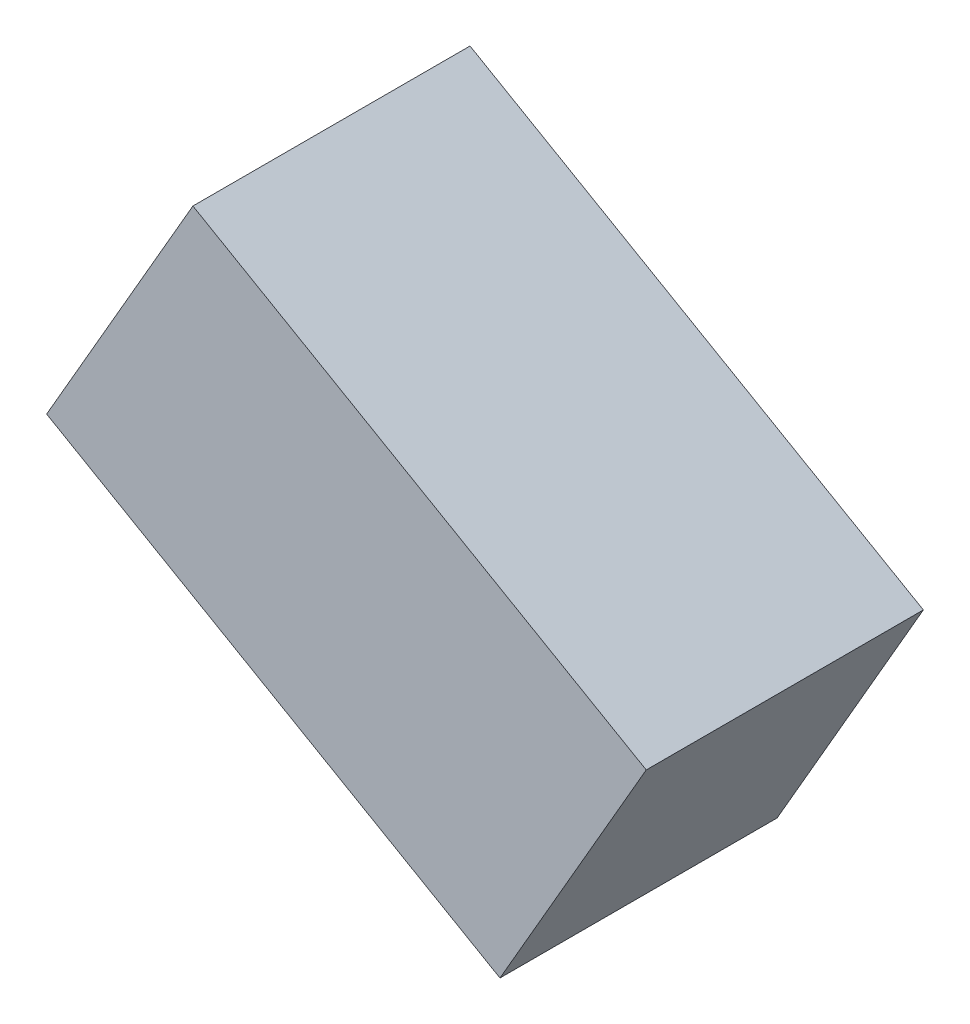
ISO-10303-21;
HEADER;
FILE_DESCRIPTION(('STEP AP214'),'2;1');
FILE_NAME('part.step','',(''),(''),'','','');
FILE_SCHEMA(('AUTOMOTIVE_DESIGN { 1 0 10303 214 1 1 1 1 }'));
ENDSEC;
DATA;
#1=APPLICATION_CONTEXT('core data for automotive mechanical design processes');
#2=APPLICATION_PROTOCOL_DEFINITION('international standard','automotive_design',2000,#1);
#3=PRODUCT_CONTEXT('',#1,'mechanical');
#4=PRODUCT('Part','Part','',(#3));
#5=PRODUCT_RELATED_PRODUCT_CATEGORY('part','',(#4));
#6=PRODUCT_DEFINITION_FORMATION('','',#4);
#7=PRODUCT_DEFINITION_CONTEXT('part definition',#1,'design');
#8=PRODUCT_DEFINITION('design','',#6,#7);
#9=PRODUCT_DEFINITION_SHAPE('','',#8);
#10=(LENGTH_UNIT() NAMED_UNIT(*) SI_UNIT(.MILLI.,.METRE.));
#11=(NAMED_UNIT(*) PLANE_ANGLE_UNIT() SI_UNIT($,.RADIAN.));
#12=(NAMED_UNIT(*) SI_UNIT($,.STERADIAN.) SOLID_ANGLE_UNIT());
#13=UNCERTAINTY_MEASURE_WITH_UNIT(LENGTH_MEASURE(1.E-05),#10,'distance_accuracy_value','');
#14=(GEOMETRIC_REPRESENTATION_CONTEXT(3) GLOBAL_UNCERTAINTY_ASSIGNED_CONTEXT((#13)) GLOBAL_UNIT_ASSIGNED_CONTEXT((#10,
#11,#12)) REPRESENTATION_CONTEXT('',''));
#15=CARTESIAN_POINT('',(0.,0.,0.));
#16=DIRECTION('',(0.,0.,1.));
#17=DIRECTION('',(1.,0.,0.));
#18=AXIS2_PLACEMENT_3D('',#15,#16,#17);
#19=CARTESIAN_POINT('',(-0.97362264,0.01363726,0.90000074));
#20=DIRECTION('',(0.,0.,-1.));
#21=DIRECTION('',(-1.,0.,0.));
#22=AXIS2_PLACEMENT_3D('',#19,#20,#21);
#23=PLANE('',#22);
#24=DIRECTION('',(-0.499999256063104,-0.86602583329618,0.));
#25=VECTOR('',#24,1.);
#26=CARTESIAN_POINT('',(0.49862232,-0.83636358,0.90000074));
#27=LINE('',#26,#25);
#28=CARTESIAN_POINT('',(0.498622320000075,-0.836363579999871,0.90000074));
#29=VERTEX_POINT('',#28);
#30=CARTESIAN_POINT('',(0.97362263999991,-0.0136372599999478,0.90000074));
#31=VERTEX_POINT('',#30);
#32=EDGE_CURVE('E55',#29,#31,#27,.F.);
#33=ORIENTED_EDGE('',*,*,#32,.T.);
#34=DIRECTION('',(0.866025450643935,-0.499999918836963,0.));
#35=VECTOR('',#34,1.);
#36=CARTESIAN_POINT('',(0.97362264,-0.01363726,0.90000074));
#37=LINE('',#36,#35);
#38=CARTESIAN_POINT('',(-0.498622320000075,0.836363579999871,0.90000074));
#39=VERTEX_POINT('',#38);
#40=EDGE_CURVE('E57',#31,#39,#37,.F.);
#41=ORIENTED_EDGE('',*,*,#40,.T.);
#42=DIRECTION('',(0.499999256063104,0.86602583329618,0.));
#43=VECTOR('',#42,1.);
#44=CARTESIAN_POINT('',(-0.49862232,0.83636358,0.90000074));
#45=LINE('',#44,#43);
#46=CARTESIAN_POINT('',(-0.973622639999819,0.0136372599998957,0.90000074));
#47=VERTEX_POINT('',#46);
#48=EDGE_CURVE('E20',#39,#47,#45,.F.);
#49=ORIENTED_EDGE('',*,*,#48,.T.);
#50=DIRECTION('',(-0.866025450643935,0.499999918836963,0.));
#51=VECTOR('',#50,1.);
#52=CARTESIAN_POINT('',(-0.97362264,0.01363726,0.90000074));
#53=LINE('',#52,#51);
#54=EDGE_CURVE('E80',#47,#29,#53,.F.);
#55=ORIENTED_EDGE('',*,*,#54,.T.);
#56=EDGE_LOOP('',(#33,#41,#49,#55));
#57=FACE_BOUND('',#56,.T.);
#58=ADVANCED_FACE('F17',(#57),#23,.F.);
#59=CARTESIAN_POINT('',(-0.49862232,0.83636358,0.));
#60=DIRECTION('',(0.86602583329618,-0.499999256063104,0.));
#61=DIRECTION('',(0.499999256063104,0.86602583329618,0.));
#62=AXIS2_PLACEMENT_3D('',#59,#60,#61);
#63=PLANE('',#62);
#64=DIRECTION('',(0.,0.,1.));
#65=VECTOR('',#64,1.);
#66=CARTESIAN_POINT('',(-0.97362264,0.01363726,0.));
#67=LINE('',#66,#65);
#68=CARTESIAN_POINT('',(-0.973622639999819,0.0136372599998957,0.));
#69=VERTEX_POINT('',#68);
#70=EDGE_CURVE('E68',#69,#47,#67,.T.);
#71=ORIENTED_EDGE('',*,*,#70,.T.);
#72=ORIENTED_EDGE('',*,*,#48,.F.);
#73=DIRECTION('',(0.,0.,1.));
#74=VECTOR('',#73,1.);
#75=CARTESIAN_POINT('',(-0.498622320000298,0.836363579999484,0.));
#76=LINE('',#75,#74);
#77=CARTESIAN_POINT('',(-0.498622320000075,0.836363579999871,0.));
#78=VERTEX_POINT('',#77);
#79=EDGE_CURVE('E63',#39,#78,#76,.F.);
#80=ORIENTED_EDGE('',*,*,#79,.T.);
#81=DIRECTION('',(0.499999256063484,0.866025833295961,0.));
#82=VECTOR('',#81,1.);
#83=CARTESIAN_POINT('',(-0.97362264,0.01363726,0.));
#84=LINE('',#83,#82);
#85=EDGE_CURVE('E83',#69,#78,#84,.T.);
#86=ORIENTED_EDGE('',*,*,#85,.F.);
#87=EDGE_LOOP('',(#71,#72,#80,#86));
#88=FACE_BOUND('',#87,.T.);
#89=ADVANCED_FACE('F65',(#88),#63,.F.);
#90=CARTESIAN_POINT('',(0.97362264,-0.01363726,0.));
#91=DIRECTION('',(-0.499999918836963,-0.866025450643935,0.));
#92=DIRECTION('',(0.866025450643935,-0.499999918836963,0.));
#93=AXIS2_PLACEMENT_3D('',#90,#91,#92);
#94=PLANE('',#93);
#95=ORIENTED_EDGE('',*,*,#79,.F.);
#96=ORIENTED_EDGE('',*,*,#40,.F.);
#97=DIRECTION('',(0.,0.,1.));
#98=VECTOR('',#97,1.);
#99=CARTESIAN_POINT('',(0.973622639999639,-0.0136372599997914,0.));
#100=LINE('',#99,#98);
#101=CARTESIAN_POINT('',(0.97362263999991,-0.0136372599999478,0.));
#102=VERTEX_POINT('',#101);
#103=EDGE_CURVE('E75',#31,#102,#100,.F.);
#104=ORIENTED_EDGE('',*,*,#103,.T.);
#105=DIRECTION('',(0.86602545064376,-0.499999918837266,0.));
#106=VECTOR('',#105,1.);
#107=CARTESIAN_POINT('',(-0.49862232,0.83636358,0.));
#108=LINE('',#107,#106);
#109=EDGE_CURVE('E72',#78,#102,#108,.T.);
#110=ORIENTED_EDGE('',*,*,#109,.F.);
#111=EDGE_LOOP('',(#95,#96,#104,#110));
#112=FACE_BOUND('',#111,.T.);
#113=ADVANCED_FACE('F70',(#112),#94,.F.);
#114=CARTESIAN_POINT('',(0.49862232,-0.83636358,0.));
#115=DIRECTION('',(-0.86602583329618,0.499999256063104,0.));
#116=DIRECTION('',(-0.499999256063104,-0.86602583329618,0.));
#117=AXIS2_PLACEMENT_3D('',#114,#115,#116);
#118=PLANE('',#117);
#119=ORIENTED_EDGE('',*,*,#103,.F.);
#120=ORIENTED_EDGE('',*,*,#32,.F.);
#121=DIRECTION('',(0.,0.,1.));
#122=VECTOR('',#121,1.);
#123=CARTESIAN_POINT('',(0.498622320000298,-0.836363579999484,0.));
#124=LINE('',#123,#122);
#125=CARTESIAN_POINT('',(0.498622320000075,-0.836363579999871,0.));
#126=VERTEX_POINT('',#125);
#127=EDGE_CURVE('E35',#29,#126,#124,.F.);
#128=ORIENTED_EDGE('',*,*,#127,.T.);
#129=DIRECTION('',(-0.499999256063484,-0.866025833295961,0.));
#130=VECTOR('',#129,1.);
#131=CARTESIAN_POINT('',(0.97362264,-0.01363726,0.));
#132=LINE('',#131,#130);
#133=EDGE_CURVE('E26',#102,#126,#132,.T.);
#134=ORIENTED_EDGE('',*,*,#133,.F.);
#135=EDGE_LOOP('',(#119,#120,#128,#134));
#136=FACE_BOUND('',#135,.T.);
#137=ADVANCED_FACE('F89',(#136),#118,.F.);
#138=CARTESIAN_POINT('',(-0.97362264,0.01363726,0.));
#139=DIRECTION('',(0.499999918836963,0.866025450643935,0.));
#140=DIRECTION('',(-0.866025450643935,0.499999918836963,0.));
#141=AXIS2_PLACEMENT_3D('',#138,#139,#140);
#142=PLANE('',#141);
#143=ORIENTED_EDGE('',*,*,#127,.F.);
#144=ORIENTED_EDGE('',*,*,#54,.F.);
#145=ORIENTED_EDGE('',*,*,#70,.F.);
#146=DIRECTION('',(-0.86602545064376,0.499999918837266,0.));
#147=VECTOR('',#146,1.);
#148=CARTESIAN_POINT('',(0.49862232,-0.83636358,0.));
#149=LINE('',#148,#147);
#150=EDGE_CURVE('E11',#126,#69,#149,.T.);
#151=ORIENTED_EDGE('',*,*,#150,.F.);
#152=EDGE_LOOP('',(#143,#144,#145,#151));
#153=FACE_BOUND('',#152,.T.);
#154=ADVANCED_FACE('F91',(#153),#142,.F.);
#155=CARTESIAN_POINT('',(-0.97362264,0.01363726,0.));
#156=DIRECTION('',(0.,0.,-1.));
#157=DIRECTION('',(-1.,0.,0.));
#158=AXIS2_PLACEMENT_3D('',#155,#156,#157);
#159=PLANE('',#158);
#160=ORIENTED_EDGE('',*,*,#133,.T.);
#161=ORIENTED_EDGE('',*,*,#150,.T.);
#162=ORIENTED_EDGE('',*,*,#85,.T.);
#163=ORIENTED_EDGE('',*,*,#109,.T.);
#164=EDGE_LOOP('',(#160,#161,#162,#163));
#165=FACE_BOUND('',#164,.T.);
#166=ADVANCED_FACE('F88',(#165),#159,.T.);
#167=CLOSED_SHELL('',(#58,#89,#113,#137,#154,#166));
#168=MANIFOLD_SOLID_BREP('B1',#167);
#169=ADVANCED_BREP_SHAPE_REPRESENTATION('',(#18,#168),#14);
#170=SHAPE_DEFINITION_REPRESENTATION(#9,#169);
ENDSEC;
END-ISO-10303-21;
